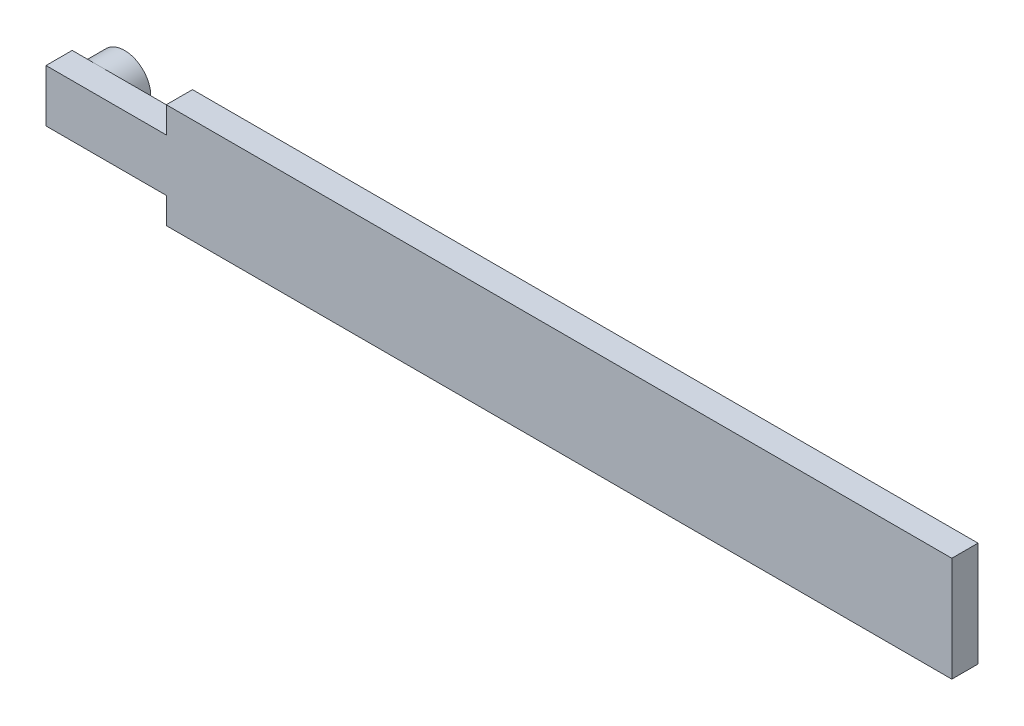
ISO-10303-21;
HEADER;
FILE_DESCRIPTION(('STEP AP214'),'2;1');
FILE_NAME('part.step','',(''),(''),'','','');
FILE_SCHEMA(('AUTOMOTIVE_DESIGN { 1 0 10303 214 1 1 1 1 }'));
ENDSEC;
DATA;
#1=APPLICATION_CONTEXT('core data for automotive mechanical design processes');
#2=APPLICATION_PROTOCOL_DEFINITION('international standard','automotive_design',2000,#1);
#3=PRODUCT_CONTEXT('',#1,'mechanical');
#4=PRODUCT('Part','Part','',(#3));
#5=PRODUCT_RELATED_PRODUCT_CATEGORY('part','',(#4));
#6=PRODUCT_DEFINITION_FORMATION('','',#4);
#7=PRODUCT_DEFINITION_CONTEXT('part definition',#1,'design');
#8=PRODUCT_DEFINITION('design','',#6,#7);
#9=PRODUCT_DEFINITION_SHAPE('','',#8);
#10=(LENGTH_UNIT() NAMED_UNIT(*) SI_UNIT(.MILLI.,.METRE.));
#11=(NAMED_UNIT(*) PLANE_ANGLE_UNIT() SI_UNIT($,.RADIAN.));
#12=(NAMED_UNIT(*) SI_UNIT($,.STERADIAN.) SOLID_ANGLE_UNIT());
#13=UNCERTAINTY_MEASURE_WITH_UNIT(LENGTH_MEASURE(1.E-05),#10,'distance_accuracy_value','');
#14=(GEOMETRIC_REPRESENTATION_CONTEXT(3) GLOBAL_UNCERTAINTY_ASSIGNED_CONTEXT((#13)) GLOBAL_UNIT_ASSIGNED_CONTEXT((#10,
#11,#12)) REPRESENTATION_CONTEXT('',''));
#15=CARTESIAN_POINT('',(0.,0.,0.));
#16=DIRECTION('',(0.,0.,1.));
#17=DIRECTION('',(1.,0.,0.));
#18=AXIS2_PLACEMENT_3D('',#15,#16,#17);
#19=CARTESIAN_POINT('',(0.,0.,0.));
#20=DIRECTION('',(0.,0.,-1.));
#21=DIRECTION('',(-1.,0.,0.));
#22=AXIS2_PLACEMENT_3D('',#19,#20,#21);
#23=PLANE('',#22);
#24=CARTESIAN_POINT('',(-92.9701305862705,0.,0.));
#25=DIRECTION('',(0.,0.,-1.));
#26=DIRECTION('',(-1.,0.,0.));
#27=AXIS2_PLACEMENT_3D('',#24,#25,#26);
#28=CIRCLE('',#27,5.);
#29=CARTESIAN_POINT('',(-97.9701305862705,0.,0.));
#30=VERTEX_POINT('',#29);
#31=CARTESIAN_POINT('',(-92.9701305862705,5.,0.));
#32=VERTEX_POINT('',#31);
#33=EDGE_CURVE('E48',#30,#32,#28,.T.);
#34=ORIENTED_EDGE('',*,*,#33,.F.);
#35=DIRECTION('',(0.,1.,0.));
#36=VECTOR('',#35,1.);
#37=CARTESIAN_POINT('',(-97.9701305862705,-4.99999999999999,0.));
#38=LINE('',#37,#36);
#39=CARTESIAN_POINT('',(-97.9701305862705,5.,0.));
#40=VERTEX_POINT('',#39);
#41=EDGE_CURVE('E118',#30,#40,#38,.T.);
#42=ORIENTED_EDGE('',*,*,#41,.T.);
#43=DIRECTION('',(-1.,0.,0.));
#44=VECTOR('',#43,1.);
#45=CARTESIAN_POINT('',(-75.,5.,0.));
#46=LINE('',#45,#44);
#47=EDGE_CURVE('E117',#32,#40,#46,.T.);
#48=ORIENTED_EDGE('',*,*,#47,.F.);
#49=EDGE_LOOP('',(#34,#42,#48));
#50=FACE_BOUND('',#49,.T.);
#51=ADVANCED_FACE('F37',(#50),#23,.T.);
#52=CARTESIAN_POINT('',(-92.9701305862705,-5.,0.));
#53=VERTEX_POINT('',#52);
#54=EDGE_CURVE('E11',#32,#53,#28,.T.);
#55=ORIENTED_EDGE('',*,*,#54,.F.);
#56=CARTESIAN_POINT('',(-75.,5.,0.));
#57=VERTEX_POINT('',#56);
#58=EDGE_CURVE('E142',#57,#32,#46,.T.);
#59=ORIENTED_EDGE('',*,*,#58,.F.);
#60=DIRECTION('',(0.,1.,0.));
#61=VECTOR('',#60,1.);
#62=CARTESIAN_POINT('',(-75.,5.,0.));
#63=LINE('',#62,#61);
#64=CARTESIAN_POINT('',(-75.,10.,0.));
#65=VERTEX_POINT('',#64);
#66=EDGE_CURVE('E159',#57,#65,#63,.T.);
#67=ORIENTED_EDGE('',*,*,#66,.T.);
#68=DIRECTION('',(1.,0.,0.));
#69=VECTOR('',#68,1.);
#70=CARTESIAN_POINT('',(-75.,10.,0.));
#71=LINE('',#70,#69);
#72=CARTESIAN_POINT('',(75.,10.,0.));
#73=VERTEX_POINT('',#72);
#74=EDGE_CURVE('E162',#65,#73,#71,.T.);
#75=ORIENTED_EDGE('',*,*,#74,.T.);
#76=DIRECTION('',(0.,1.,0.));
#77=VECTOR('',#76,1.);
#78=CARTESIAN_POINT('',(75.,-10.,0.));
#79=LINE('',#78,#77);
#80=CARTESIAN_POINT('',(75.,-10.,0.));
#81=VERTEX_POINT('',#80);
#82=EDGE_CURVE('E165',#81,#73,#79,.T.);
#83=ORIENTED_EDGE('',*,*,#82,.F.);
#84=DIRECTION('',(1.,0.,0.));
#85=VECTOR('',#84,1.);
#86=CARTESIAN_POINT('',(-75.,-10.,0.));
#87=LINE('',#86,#85);
#88=CARTESIAN_POINT('',(-75.,-10.,0.));
#89=VERTEX_POINT('',#88);
#90=EDGE_CURVE('E168',#89,#81,#87,.T.);
#91=ORIENTED_EDGE('',*,*,#90,.F.);
#92=DIRECTION('',(0.,1.,0.));
#93=VECTOR('',#92,1.);
#94=CARTESIAN_POINT('',(-75.,-10.,0.));
#95=LINE('',#94,#93);
#96=CARTESIAN_POINT('',(-75.,-5.,0.));
#97=VERTEX_POINT('',#96);
#98=EDGE_CURVE('E170',#89,#97,#95,.T.);
#99=ORIENTED_EDGE('',*,*,#98,.T.);
#100=DIRECTION('',(-1.,0.,0.));
#101=VECTOR('',#100,1.);
#102=CARTESIAN_POINT('',(-75.,-5.,0.));
#103=LINE('',#102,#101);
#104=EDGE_CURVE('E128',#97,#53,#103,.T.);
#105=ORIENTED_EDGE('',*,*,#104,.T.);
#106=EDGE_LOOP('',(#55,#59,#67,#75,#83,#91,#99,#105));
#107=FACE_BOUND('',#106,.T.);
#108=ADVANCED_FACE('F194',(#107),#23,.T.);
#109=CARTESIAN_POINT('',(-75.,5.,5.));
#110=DIRECTION('',(-1.,0.,0.));
#111=DIRECTION('',(0.,-1.,0.));
#112=AXIS2_PLACEMENT_3D('',#109,#110,#111);
#113=PLANE('',#112);
#114=ORIENTED_EDGE('',*,*,#66,.F.);
#115=DIRECTION('',(0.,0.,-1.));
#116=VECTOR('',#115,1.);
#117=CARTESIAN_POINT('',(-75.,5.,5.));
#118=LINE('',#117,#116);
#119=CARTESIAN_POINT('',(-75.,5.,5.));
#120=VERTEX_POINT('',#119);
#121=EDGE_CURVE('E134',#120,#57,#118,.T.);
#122=ORIENTED_EDGE('',*,*,#121,.F.);
#123=DIRECTION('',(0.,1.,0.));
#124=VECTOR('',#123,1.);
#125=CARTESIAN_POINT('',(-75.,5.,5.));
#126=LINE('',#125,#124);
#127=CARTESIAN_POINT('',(-75.,10.,5.));
#128=VERTEX_POINT('',#127);
#129=EDGE_CURVE('E138',#120,#128,#126,.T.);
#130=ORIENTED_EDGE('',*,*,#129,.T.);
#131=DIRECTION('',(0.,0.,-1.));
#132=VECTOR('',#131,1.);
#133=CARTESIAN_POINT('',(-75.,10.,5.));
#134=LINE('',#133,#132);
#135=EDGE_CURVE('E41',#128,#65,#134,.T.);
#136=ORIENTED_EDGE('',*,*,#135,.T.);
#137=EDGE_LOOP('',(#114,#122,#130,#136));
#138=FACE_BOUND('',#137,.T.);
#139=ADVANCED_FACE('F39',(#138),#113,.T.);
#140=CARTESIAN_POINT('',(-75.,5.,5.));
#141=DIRECTION('',(0.,-1.,0.));
#142=DIRECTION('',(1.,0.,0.));
#143=AXIS2_PLACEMENT_3D('',#140,#141,#142);
#144=PLANE('',#143);
#145=ORIENTED_EDGE('',*,*,#58,.T.);
#146=ORIENTED_EDGE('',*,*,#47,.T.);
#147=DIRECTION('',(0.,0.,-1.));
#148=VECTOR('',#147,1.);
#149=CARTESIAN_POINT('',(-97.9701305862705,5.,5.));
#150=LINE('',#149,#148);
#151=CARTESIAN_POINT('',(-97.9701305862705,5.,5.));
#152=VERTEX_POINT('',#151);
#153=EDGE_CURVE('E126',#152,#40,#150,.T.);
#154=ORIENTED_EDGE('',*,*,#153,.F.);
#155=DIRECTION('',(-1.,0.,0.));
#156=VECTOR('',#155,1.);
#157=CARTESIAN_POINT('',(-75.,5.,5.));
#158=LINE('',#157,#156);
#159=EDGE_CURVE('E157',#120,#152,#158,.T.);
#160=ORIENTED_EDGE('',*,*,#159,.F.);
#161=ORIENTED_EDGE('',*,*,#121,.T.);
#162=EDGE_LOOP('',(#145,#146,#154,#160,#161));
#163=FACE_BOUND('',#162,.T.);
#164=ADVANCED_FACE('F196',(#163),#144,.F.);
#165=CARTESIAN_POINT('',(-97.9701305862705,-4.99999999999999,5.));
#166=DIRECTION('',(-1.,0.,0.));
#167=DIRECTION('',(0.,0.,1.));
#168=AXIS2_PLACEMENT_3D('',#165,#166,#167);
#169=PLANE('',#168);
#170=CARTESIAN_POINT('',(-97.9701305862705,-4.99999999999999,0.));
#171=VERTEX_POINT('',#170);
#172=EDGE_CURVE('E111',#171,#30,#38,.T.);
#173=ORIENTED_EDGE('',*,*,#172,.F.);
#174=DIRECTION('',(0.,0.,-1.));
#175=VECTOR('',#174,1.);
#176=CARTESIAN_POINT('',(-97.9701305862705,-4.99999999999999,5.));
#177=LINE('',#176,#175);
#178=CARTESIAN_POINT('',(-97.9701305862705,-4.99999999999999,5.));
#179=VERTEX_POINT('',#178);
#180=EDGE_CURVE('E176',#179,#171,#177,.T.);
#181=ORIENTED_EDGE('',*,*,#180,.F.);
#182=DIRECTION('',(0.,1.,0.));
#183=VECTOR('',#182,1.);
#184=CARTESIAN_POINT('',(-97.9701305862705,-4.99999999999999,5.));
#185=LINE('',#184,#183);
#186=EDGE_CURVE('E155',#179,#152,#185,.T.);
#187=ORIENTED_EDGE('',*,*,#186,.T.);
#188=ORIENTED_EDGE('',*,*,#153,.T.);
#189=ORIENTED_EDGE('',*,*,#41,.F.);
#190=EDGE_LOOP('',(#173,#181,#187,#188,#189));
#191=FACE_BOUND('',#190,.T.);
#192=ADVANCED_FACE('F123',(#191),#169,.T.);
#193=CARTESIAN_POINT('',(-75.,-5.,5.));
#194=DIRECTION('',(0.,-1.,0.));
#195=DIRECTION('',(1.,0.,0.));
#196=AXIS2_PLACEMENT_3D('',#193,#194,#195);
#197=PLANE('',#196);
#198=ORIENTED_EDGE('',*,*,#104,.F.);
#199=DIRECTION('',(0.,0.,-1.));
#200=VECTOR('',#199,1.);
#201=CARTESIAN_POINT('',(-75.,-5.,5.));
#202=LINE('',#201,#200);
#203=CARTESIAN_POINT('',(-75.,-5.,5.));
#204=VERTEX_POINT('',#203);
#205=EDGE_CURVE('E178',#204,#97,#202,.T.);
#206=ORIENTED_EDGE('',*,*,#205,.F.);
#207=DIRECTION('',(-1.,0.,0.));
#208=VECTOR('',#207,1.);
#209=CARTESIAN_POINT('',(-75.,-5.,5.));
#210=LINE('',#209,#208);
#211=EDGE_CURVE('E152',#204,#179,#210,.T.);
#212=ORIENTED_EDGE('',*,*,#211,.T.);
#213=ORIENTED_EDGE('',*,*,#180,.T.);
#214=EDGE_CURVE('E114',#53,#171,#103,.T.);
#215=ORIENTED_EDGE('',*,*,#214,.F.);
#216=EDGE_LOOP('',(#198,#206,#212,#213,#215));
#217=FACE_BOUND('',#216,.T.);
#218=ADVANCED_FACE('F215',(#217),#197,.T.);
#219=CARTESIAN_POINT('',(-75.,-10.,5.));
#220=DIRECTION('',(-1.,0.,0.));
#221=DIRECTION('',(0.,-1.,0.));
#222=AXIS2_PLACEMENT_3D('',#219,#220,#221);
#223=PLANE('',#222);
#224=ORIENTED_EDGE('',*,*,#98,.F.);
#225=DIRECTION('',(0.,0.,-1.));
#226=VECTOR('',#225,1.);
#227=CARTESIAN_POINT('',(-75.,-10.,5.));
#228=LINE('',#227,#226);
#229=CARTESIAN_POINT('',(-75.,-10.,5.));
#230=VERTEX_POINT('',#229);
#231=EDGE_CURVE('E180',#230,#89,#228,.T.);
#232=ORIENTED_EDGE('',*,*,#231,.F.);
#233=DIRECTION('',(0.,1.,0.));
#234=VECTOR('',#233,1.);
#235=CARTESIAN_POINT('',(-75.,-10.,5.));
#236=LINE('',#235,#234);
#237=EDGE_CURVE('E149',#230,#204,#236,.T.);
#238=ORIENTED_EDGE('',*,*,#237,.T.);
#239=ORIENTED_EDGE('',*,*,#205,.T.);
#240=EDGE_LOOP('',(#224,#232,#238,#239));
#241=FACE_BOUND('',#240,.T.);
#242=ADVANCED_FACE('F211',(#241),#223,.T.);
#243=CARTESIAN_POINT('',(-75.,-10.,5.));
#244=DIRECTION('',(0.,1.,0.));
#245=DIRECTION('',(-1.,0.,0.));
#246=AXIS2_PLACEMENT_3D('',#243,#244,#245);
#247=PLANE('',#246);
#248=ORIENTED_EDGE('',*,*,#90,.T.);
#249=DIRECTION('',(0.,0.,-1.));
#250=VECTOR('',#249,1.);
#251=CARTESIAN_POINT('',(75.,-10.,5.));
#252=LINE('',#251,#250);
#253=CARTESIAN_POINT('',(75.,-10.,5.));
#254=VERTEX_POINT('',#253);
#255=EDGE_CURVE('E182',#254,#81,#252,.T.);
#256=ORIENTED_EDGE('',*,*,#255,.F.);
#257=DIRECTION('',(1.,0.,0.));
#258=VECTOR('',#257,1.);
#259=CARTESIAN_POINT('',(-75.,-10.,5.));
#260=LINE('',#259,#258);
#261=EDGE_CURVE('E147',#230,#254,#260,.T.);
#262=ORIENTED_EDGE('',*,*,#261,.F.);
#263=ORIENTED_EDGE('',*,*,#231,.T.);
#264=EDGE_LOOP('',(#248,#256,#262,#263));
#265=FACE_BOUND('',#264,.T.);
#266=ADVANCED_FACE('F222',(#265),#247,.F.);
#267=CARTESIAN_POINT('',(75.,-10.,5.));
#268=DIRECTION('',(-1.,0.,0.));
#269=DIRECTION('',(0.,0.,1.));
#270=AXIS2_PLACEMENT_3D('',#267,#268,#269);
#271=PLANE('',#270);
#272=ORIENTED_EDGE('',*,*,#82,.T.);
#273=DIRECTION('',(0.,0.,-1.));
#274=VECTOR('',#273,1.);
#275=CARTESIAN_POINT('',(75.,10.,5.));
#276=LINE('',#275,#274);
#277=CARTESIAN_POINT('',(75.,10.,5.));
#278=VERTEX_POINT('',#277);
#279=EDGE_CURVE('E184',#278,#73,#276,.T.);
#280=ORIENTED_EDGE('',*,*,#279,.F.);
#281=DIRECTION('',(0.,1.,0.));
#282=VECTOR('',#281,1.);
#283=CARTESIAN_POINT('',(75.,-10.,5.));
#284=LINE('',#283,#282);
#285=EDGE_CURVE('E145',#254,#278,#284,.T.);
#286=ORIENTED_EDGE('',*,*,#285,.F.);
#287=ORIENTED_EDGE('',*,*,#255,.T.);
#288=EDGE_LOOP('',(#272,#280,#286,#287));
#289=FACE_BOUND('',#288,.T.);
#290=ADVANCED_FACE('F206',(#289),#271,.F.);
#291=CARTESIAN_POINT('',(-75.,10.,5.));
#292=DIRECTION('',(0.,1.,0.));
#293=DIRECTION('',(0.,0.,1.));
#294=AXIS2_PLACEMENT_3D('',#291,#292,#293);
#295=PLANE('',#294);
#296=ORIENTED_EDGE('',*,*,#74,.F.);
#297=ORIENTED_EDGE('',*,*,#135,.F.);
#298=DIRECTION('',(1.,0.,0.));
#299=VECTOR('',#298,1.);
#300=CARTESIAN_POINT('',(-75.,10.,5.));
#301=LINE('',#300,#299);
#302=EDGE_CURVE('E141',#128,#278,#301,.T.);
#303=ORIENTED_EDGE('',*,*,#302,.T.);
#304=ORIENTED_EDGE('',*,*,#279,.T.);
#305=EDGE_LOOP('',(#296,#297,#303,#304));
#306=FACE_BOUND('',#305,.T.);
#307=ADVANCED_FACE('F192',(#306),#295,.T.);
#308=CARTESIAN_POINT('',(0.,0.,5.));
#309=DIRECTION('',(0.,0.,-1.));
#310=DIRECTION('',(-1.,0.,0.));
#311=AXIS2_PLACEMENT_3D('',#308,#309,#310);
#312=PLANE('',#311);
#313=ORIENTED_EDGE('',*,*,#129,.F.);
#314=ORIENTED_EDGE('',*,*,#159,.T.);
#315=ORIENTED_EDGE('',*,*,#186,.F.);
#316=ORIENTED_EDGE('',*,*,#211,.F.);
#317=ORIENTED_EDGE('',*,*,#237,.F.);
#318=ORIENTED_EDGE('',*,*,#261,.T.);
#319=ORIENTED_EDGE('',*,*,#285,.T.);
#320=ORIENTED_EDGE('',*,*,#302,.F.);
#321=EDGE_LOOP('',(#313,#314,#315,#316,#317,#318,#319,#320));
#322=FACE_BOUND('',#321,.T.);
#323=ADVANCED_FACE('F200',(#322),#312,.F.);
#324=EDGE_CURVE('E46',#53,#30,#28,.T.);
#325=ORIENTED_EDGE('',*,*,#324,.F.);
#326=ORIENTED_EDGE('',*,*,#214,.T.);
#327=ORIENTED_EDGE('',*,*,#172,.T.);
#328=EDGE_LOOP('',(#325,#326,#327));
#329=FACE_BOUND('',#328,.T.);
#330=ADVANCED_FACE('F113',(#329),#23,.T.);
#331=CARTESIAN_POINT('',(-92.9701305862705,0.,-5.));
#332=DIRECTION('',(0.,0.,1.));
#333=DIRECTION('',(1.,0.,0.));
#334=AXIS2_PLACEMENT_3D('',#331,#332,#333);
#335=CYLINDRICAL_SURFACE('',#334,5.);
#336=CARTESIAN_POINT('',(-92.9701305862705,0.,-5.));
#337=DIRECTION('',(0.,0.,-1.));
#338=DIRECTION('',(-1.,0.,0.));
#339=AXIS2_PLACEMENT_3D('',#336,#337,#338);
#340=CIRCLE('',#339,5.);
#341=CARTESIAN_POINT('',(-97.9701305862705,0.,-5.));
#342=VERTEX_POINT('',#341);
#343=EDGE_CURVE('E132',#342,#342,#340,.T.);
#344=ORIENTED_EDGE('',*,*,#343,.F.);
#345=EDGE_LOOP('',(#344));
#346=FACE_BOUND('',#345,.T.);
#347=ORIENTED_EDGE('',*,*,#33,.T.);
#348=ORIENTED_EDGE('',*,*,#54,.T.);
#349=ORIENTED_EDGE('',*,*,#324,.T.);
#350=EDGE_LOOP('',(#347,#348,#349));
#351=FACE_BOUND('',#350,.T.);
#352=ADVANCED_FACE('F133',(#346,#351),#335,.T.);
#353=CARTESIAN_POINT('',(-92.9701305862705,0.,-5.));
#354=DIRECTION('',(0.,0.,-1.));
#355=DIRECTION('',(-1.,0.,0.));
#356=AXIS2_PLACEMENT_3D('',#353,#354,#355);
#357=PLANE('',#356);
#358=ORIENTED_EDGE('',*,*,#343,.T.);
#359=EDGE_LOOP('',(#358));
#360=FACE_BOUND('',#359,.T.);
#361=ADVANCED_FACE('F237',(#360),#357,.T.);
#362=CLOSED_SHELL('',(#51,#108,#139,#164,#192,#218,#242,#266,#290,#307,#323,#330,#352,#361));
#363=MANIFOLD_SOLID_BREP('B2',#362);
#364=ADVANCED_BREP_SHAPE_REPRESENTATION('',(#18,#363),#14);
#365=SHAPE_DEFINITION_REPRESENTATION(#9,#364);
ENDSEC;
END-ISO-10303-21;
